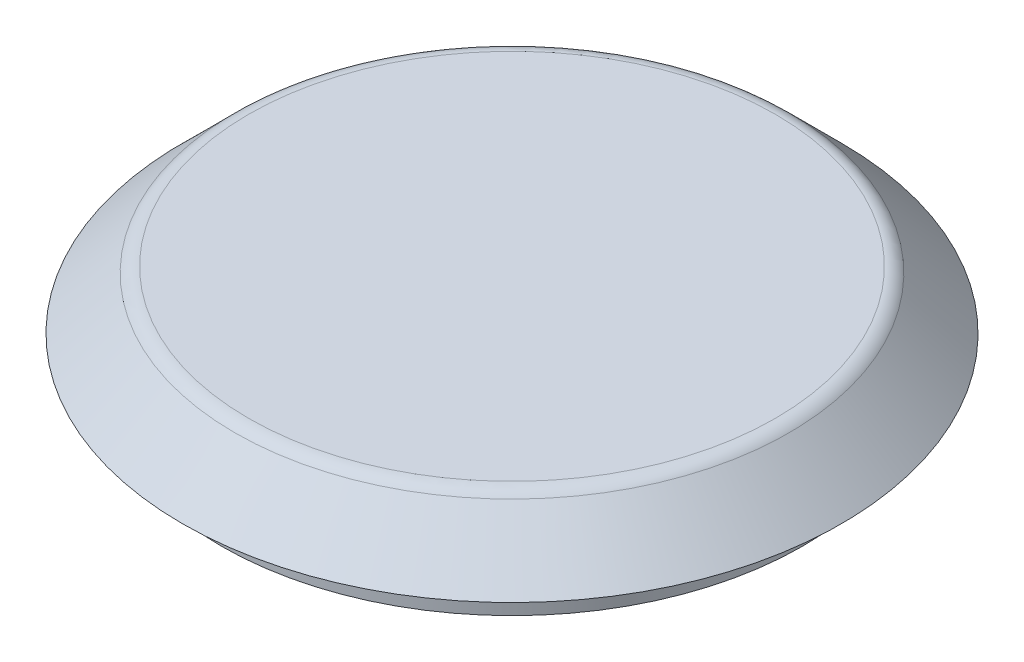
ISO-10303-21;
HEADER;
FILE_DESCRIPTION(('STEP AP214'),'2;1');
FILE_NAME('part.step','',(''),(''),'','','');
FILE_SCHEMA(('AUTOMOTIVE_DESIGN { 1 0 10303 214 1 1 1 1 }'));
ENDSEC;
DATA;
#1=APPLICATION_CONTEXT('core data for automotive mechanical design processes');
#2=APPLICATION_PROTOCOL_DEFINITION('international standard','automotive_design',2000,#1);
#3=PRODUCT_CONTEXT('',#1,'mechanical');
#4=PRODUCT('Part','Part','',(#3));
#5=PRODUCT_RELATED_PRODUCT_CATEGORY('part','',(#4));
#6=PRODUCT_DEFINITION_FORMATION('','',#4);
#7=PRODUCT_DEFINITION_CONTEXT('part definition',#1,'design');
#8=PRODUCT_DEFINITION('design','',#6,#7);
#9=PRODUCT_DEFINITION_SHAPE('','',#8);
#10=(LENGTH_UNIT() NAMED_UNIT(*) SI_UNIT(.MILLI.,.METRE.));
#11=(NAMED_UNIT(*) PLANE_ANGLE_UNIT() SI_UNIT($,.RADIAN.));
#12=(NAMED_UNIT(*) SI_UNIT($,.STERADIAN.) SOLID_ANGLE_UNIT());
#13=UNCERTAINTY_MEASURE_WITH_UNIT(LENGTH_MEASURE(1.E-05),#10,'distance_accuracy_value','');
#14=(GEOMETRIC_REPRESENTATION_CONTEXT(3) GLOBAL_UNCERTAINTY_ASSIGNED_CONTEXT((#13)) GLOBAL_UNIT_ASSIGNED_CONTEXT((#10,
#11,#12)) REPRESENTATION_CONTEXT('',''));
#15=CARTESIAN_POINT('',(0.,0.,0.));
#16=DIRECTION('',(0.,0.,1.));
#17=DIRECTION('',(1.,0.,0.));
#18=AXIS2_PLACEMENT_3D('',#15,#16,#17);
#19=CARTESIAN_POINT('',(0.,0.,0.));
#20=DIRECTION('',(0.,1.,0.));
#21=DIRECTION('',(0.,0.,1.));
#22=AXIS2_PLACEMENT_3D('',#19,#20,#21);
#23=PLANE('',#22);
#24=CARTESIAN_POINT('',(0.,0.,0.));
#25=DIRECTION('',(0.,1.,0.));
#26=DIRECTION('',(0.,0.,1.));
#27=AXIS2_PLACEMENT_3D('',#24,#25,#26);
#28=CIRCLE('',#27,14.);
#29=CARTESIAN_POINT('',(0.,0.,14.));
#30=VERTEX_POINT('',#29);
#31=EDGE_CURVE('E52',#30,#30,#28,.T.);
#32=ORIENTED_EDGE('',*,*,#31,.T.);
#33=EDGE_LOOP('',(#32));
#34=FACE_BOUND('',#33,.T.);
#35=CARTESIAN_POINT('',(0.,0.,0.));
#36=DIRECTION('',(0.,1.,0.));
#37=DIRECTION('',(0.,0.,1.));
#38=AXIS2_PLACEMENT_3D('',#35,#36,#37);
#39=CIRCLE('',#38,15.);
#40=CARTESIAN_POINT('',(0.,0.,15.));
#41=VERTEX_POINT('',#40);
#42=EDGE_CURVE('E10',#41,#41,#39,.T.);
#43=ORIENTED_EDGE('',*,*,#42,.F.);
#44=EDGE_LOOP('',(#43));
#45=FACE_BOUND('',#44,.T.);
#46=ADVANCED_FACE('F30',(#34,#45),#23,.F.);
#47=CARTESIAN_POINT('',(0.,5.,0.));
#48=DIRECTION('',(0.,1.,0.));
#49=DIRECTION('',(0.,0.,1.));
#50=AXIS2_PLACEMENT_3D('',#47,#48,#49);
#51=CYLINDRICAL_SURFACE('',#50,15.);
#52=CARTESIAN_POINT('',(0.,2.,0.));
#53=DIRECTION('',(0.,1.,0.));
#54=DIRECTION('',(0.,0.,1.));
#55=AXIS2_PLACEMENT_3D('',#52,#53,#54);
#56=CIRCLE('',#55,15.);
#57=CARTESIAN_POINT('',(0.,2.,15.));
#58=VERTEX_POINT('',#57);
#59=EDGE_CURVE('E36',#58,#58,#56,.T.);
#60=ORIENTED_EDGE('',*,*,#59,.F.);
#61=EDGE_LOOP('',(#60));
#62=FACE_BOUND('',#61,.T.);
#63=ORIENTED_EDGE('',*,*,#42,.T.);
#64=EDGE_LOOP('',(#63));
#65=FACE_BOUND('',#64,.T.);
#66=ADVANCED_FACE('F83',(#62,#65),#51,.T.);
#67=CARTESIAN_POINT('',(15.,2.,0.));
#68=DIRECTION('',(0.,1.,0.));
#69=DIRECTION('',(0.,0.,1.));
#70=AXIS2_PLACEMENT_3D('',#67,#68,#69);
#71=PLANE('',#70);
#72=CARTESIAN_POINT('',(0.,2.,0.));
#73=DIRECTION('',(0.,1.,0.));
#74=DIRECTION('',(0.,0.,1.));
#75=AXIS2_PLACEMENT_3D('',#72,#73,#74);
#76=CIRCLE('',#75,17.);
#77=CARTESIAN_POINT('',(0.,2.,17.));
#78=VERTEX_POINT('',#77);
#79=EDGE_CURVE('E40',#78,#78,#76,.T.);
#80=ORIENTED_EDGE('',*,*,#79,.F.);
#81=EDGE_LOOP('',(#80));
#82=FACE_BOUND('',#81,.T.);
#83=ORIENTED_EDGE('',*,*,#59,.T.);
#84=EDGE_LOOP('',(#83));
#85=FACE_BOUND('',#84,.T.);
#86=ADVANCED_FACE('F88',(#82,#85),#71,.F.);
#87=CARTESIAN_POINT('',(0.,2.,0.));
#88=DIRECTION('',(0.,-1.,0.));
#89=DIRECTION('',(0.,0.,-1.));
#90=AXIS2_PLACEMENT_3D('',#87,#88,#89);
#91=CONICAL_SURFACE('',#90,17.,0.785398163397449);
#92=CARTESIAN_POINT('',(0.,4.70710678118655,0.));
#93=DIRECTION('',(0.,1.,0.));
#94=DIRECTION('',(0.,0.,1.));
#95=AXIS2_PLACEMENT_3D('',#92,#93,#94);
#96=CIRCLE('',#95,14.2928932188135);
#97=CARTESIAN_POINT('',(0.,4.70710678118655,14.2928932188135));
#98=VERTEX_POINT('',#97);
#99=EDGE_CURVE('E44',#98,#98,#96,.T.);
#100=ORIENTED_EDGE('',*,*,#99,.F.);
#101=EDGE_LOOP('',(#100));
#102=FACE_BOUND('',#101,.T.);
#103=ORIENTED_EDGE('',*,*,#79,.T.);
#104=EDGE_LOOP('',(#103));
#105=FACE_BOUND('',#104,.T.);
#106=ADVANCED_FACE('F95',(#102,#105),#91,.T.);
#107=CARTESIAN_POINT('',(0.,4.,0.));
#108=DIRECTION('',(0.,1.,0.));
#109=DIRECTION('',(0.,0.,1.));
#110=AXIS2_PLACEMENT_3D('',#107,#108,#109);
#111=TOROIDAL_SURFACE('',#110,13.5857864376269,1.);
#112=CARTESIAN_POINT('',(0.,5.,0.));
#113=DIRECTION('',(0.,1.,0.));
#114=DIRECTION('',(0.,0.,1.));
#115=AXIS2_PLACEMENT_3D('',#112,#113,#114);
#116=CIRCLE('',#115,13.5857864376269);
#117=CARTESIAN_POINT('',(0.,5.,13.5857864376269));
#118=VERTEX_POINT('',#117);
#119=EDGE_CURVE('E49',#118,#118,#116,.T.);
#120=ORIENTED_EDGE('',*,*,#119,.F.);
#121=EDGE_LOOP('',(#120));
#122=FACE_BOUND('',#121,.T.);
#123=ORIENTED_EDGE('',*,*,#99,.T.);
#124=EDGE_LOOP('',(#123));
#125=FACE_BOUND('',#124,.T.);
#126=ADVANCED_FACE('F101',(#122,#125),#111,.T.);
#127=CARTESIAN_POINT('',(13.5857864376269,5.,0.));
#128=DIRECTION('',(0.,-1.,0.));
#129=DIRECTION('',(0.,0.,-1.));
#130=AXIS2_PLACEMENT_3D('',#127,#128,#129);
#131=PLANE('',#130);
#132=ORIENTED_EDGE('',*,*,#119,.T.);
#133=EDGE_LOOP('',(#132));
#134=FACE_BOUND('',#133,.T.);
#135=ADVANCED_FACE('F80',(#134),#131,.F.);
#136=CARTESIAN_POINT('',(0.,5.,0.));
#137=DIRECTION('',(0.,1.,0.));
#138=DIRECTION('',(0.,0.,1.));
#139=AXIS2_PLACEMENT_3D('',#136,#137,#138);
#140=CYLINDRICAL_SURFACE('',#139,14.);
#141=CARTESIAN_POINT('',(0.,3.,0.));
#142=DIRECTION('',(0.,1.,0.));
#143=DIRECTION('',(0.,0.,1.));
#144=AXIS2_PLACEMENT_3D('',#141,#142,#143);
#145=CIRCLE('',#144,14.);
#146=CARTESIAN_POINT('',(0.,3.,14.));
#147=VERTEX_POINT('',#146);
#148=EDGE_CURVE('E55',#147,#147,#145,.T.);
#149=ORIENTED_EDGE('',*,*,#148,.T.);
#150=EDGE_LOOP('',(#149));
#151=FACE_BOUND('',#150,.T.);
#152=ORIENTED_EDGE('',*,*,#31,.F.);
#153=EDGE_LOOP('',(#152));
#154=FACE_BOUND('',#153,.T.);
#155=ADVANCED_FACE('F65',(#151,#154),#140,.F.);
#156=CARTESIAN_POINT('',(15.,3.,0.));
#157=DIRECTION('',(0.,1.,0.));
#158=DIRECTION('',(0.,0.,1.));
#159=AXIS2_PLACEMENT_3D('',#156,#157,#158);
#160=PLANE('',#159);
#161=CARTESIAN_POINT('',(0.,3.,0.));
#162=DIRECTION('',(0.,1.,0.));
#163=DIRECTION('',(0.,0.,1.));
#164=AXIS2_PLACEMENT_3D('',#161,#162,#163);
#165=CIRCLE('',#164,14.5857864376269);
#166=CARTESIAN_POINT('',(0.,3.,14.5857864376269));
#167=VERTEX_POINT('',#166);
#168=EDGE_CURVE('E59',#167,#167,#165,.T.);
#169=ORIENTED_EDGE('',*,*,#168,.T.);
#170=EDGE_LOOP('',(#169));
#171=FACE_BOUND('',#170,.T.);
#172=ORIENTED_EDGE('',*,*,#148,.F.);
#173=EDGE_LOOP('',(#172));
#174=FACE_BOUND('',#173,.T.);
#175=ADVANCED_FACE('F68',(#171,#174),#160,.T.);
#176=CARTESIAN_POINT('',(0.,1.29289321881345,0.));
#177=DIRECTION('',(0.,-1.,0.));
#178=DIRECTION('',(0.,0.,-1.));
#179=AXIS2_PLACEMENT_3D('',#176,#177,#178);
#180=CONICAL_SURFACE('',#179,16.2928932188135,0.785398163397449);
#181=CARTESIAN_POINT('',(0.,4.,0.));
#182=DIRECTION('',(0.,-1.,0.));
#183=DIRECTION('',(0.,0.,-1.));
#184=AXIS2_PLACEMENT_3D('',#181,#182,#183);
#185=CIRCLE('',#184,13.5857864376269);
#186=CARTESIAN_POINT('',(0.,4.,-13.5857864376269));
#187=VERTEX_POINT('',#186);
#188=EDGE_CURVE('E56',#187,#187,#185,.F.);
#189=ORIENTED_EDGE('',*,*,#188,.T.);
#190=EDGE_LOOP('',(#189));
#191=FACE_BOUND('',#190,.T.);
#192=ORIENTED_EDGE('',*,*,#168,.F.);
#193=EDGE_LOOP('',(#192));
#194=FACE_BOUND('',#193,.T.);
#195=ADVANCED_FACE('F70',(#191,#194),#180,.F.);
#196=CARTESIAN_POINT('',(13.5857864376269,4.,0.));
#197=DIRECTION('',(0.,-1.,0.));
#198=DIRECTION('',(0.,0.,-1.));
#199=AXIS2_PLACEMENT_3D('',#196,#197,#198);
#200=PLANE('',#199);
#201=ORIENTED_EDGE('',*,*,#188,.F.);
#202=EDGE_LOOP('',(#201));
#203=FACE_BOUND('',#202,.T.);
#204=ADVANCED_FACE('F77',(#203),#200,.T.);
#205=CLOSED_SHELL('',(#46,#66,#86,#106,#126,#135,#155,#175,#195,#204));
#206=MANIFOLD_SOLID_BREP('B2',#205);
#207=ADVANCED_BREP_SHAPE_REPRESENTATION('',(#18,#206),#14);
#208=SHAPE_DEFINITION_REPRESENTATION(#9,#207);
ENDSEC;
END-ISO-10303-21;
